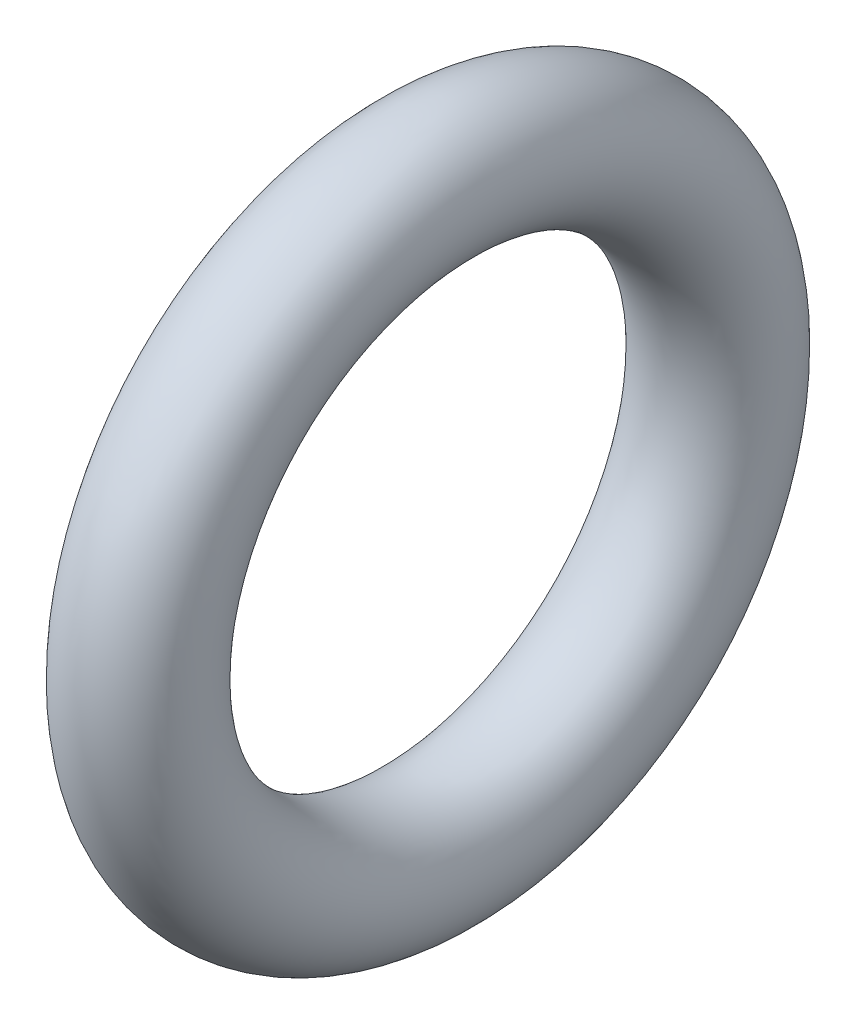
ISO-10303-21;
HEADER;
FILE_DESCRIPTION(('STEP AP214'),'2;1');
FILE_NAME('part.step','',(''),(''),'','','');
FILE_SCHEMA(('AUTOMOTIVE_DESIGN { 1 0 10303 214 1 1 1 1 }'));
ENDSEC;
DATA;
#1=APPLICATION_CONTEXT('core data for automotive mechanical design processes');
#2=APPLICATION_PROTOCOL_DEFINITION('international standard','automotive_design',2000,#1);
#3=PRODUCT_CONTEXT('',#1,'mechanical');
#4=PRODUCT('Part','Part','',(#3));
#5=PRODUCT_RELATED_PRODUCT_CATEGORY('part','',(#4));
#6=PRODUCT_DEFINITION_FORMATION('','',#4);
#7=PRODUCT_DEFINITION_CONTEXT('part definition',#1,'design');
#8=PRODUCT_DEFINITION('design','',#6,#7);
#9=PRODUCT_DEFINITION_SHAPE('','',#8);
#10=(LENGTH_UNIT() NAMED_UNIT(*) SI_UNIT(.MILLI.,.METRE.));
#11=(NAMED_UNIT(*) PLANE_ANGLE_UNIT() SI_UNIT($,.RADIAN.));
#12=(NAMED_UNIT(*) SI_UNIT($,.STERADIAN.) SOLID_ANGLE_UNIT());
#13=UNCERTAINTY_MEASURE_WITH_UNIT(LENGTH_MEASURE(1.E-05),#10,'distance_accuracy_value','');
#14=(GEOMETRIC_REPRESENTATION_CONTEXT(3) GLOBAL_UNCERTAINTY_ASSIGNED_CONTEXT((#13)) GLOBAL_UNIT_ASSIGNED_CONTEXT((#10,
#11,#12)) REPRESENTATION_CONTEXT('',''));
#15=CARTESIAN_POINT('',(0.,0.,0.));
#16=DIRECTION('',(0.,0.,1.));
#17=DIRECTION('',(1.,0.,0.));
#18=AXIS2_PLACEMENT_3D('',#15,#16,#17);
#19=CARTESIAN_POINT('',(0.,0.,0.));
#20=DIRECTION('',(1.,0.,0.));
#21=DIRECTION('',(0.,0.,-1.));
#22=AXIS2_PLACEMENT_3D('',#19,#20,#21);
#23=TOROIDAL_SURFACE('',#22,5.8,1.3);
#24=CARTESIAN_POINT('',(0.,0.,-7.1));
#25=VERTEX_POINT('',#24);
#26=VERTEX_LOOP('',#25);
#27=FACE_BOUND('',#26,.T.);
#28=ADVANCED_FACE('F33',(#27),#23,.T.);
#29=CLOSED_SHELL('',(#28));
#30=MANIFOLD_SOLID_BREP('B2',#29);
#31=ADVANCED_BREP_SHAPE_REPRESENTATION('',(#18,#30),#14);
#32=SHAPE_DEFINITION_REPRESENTATION(#9,#31);
ENDSEC;
END-ISO-10303-21;
